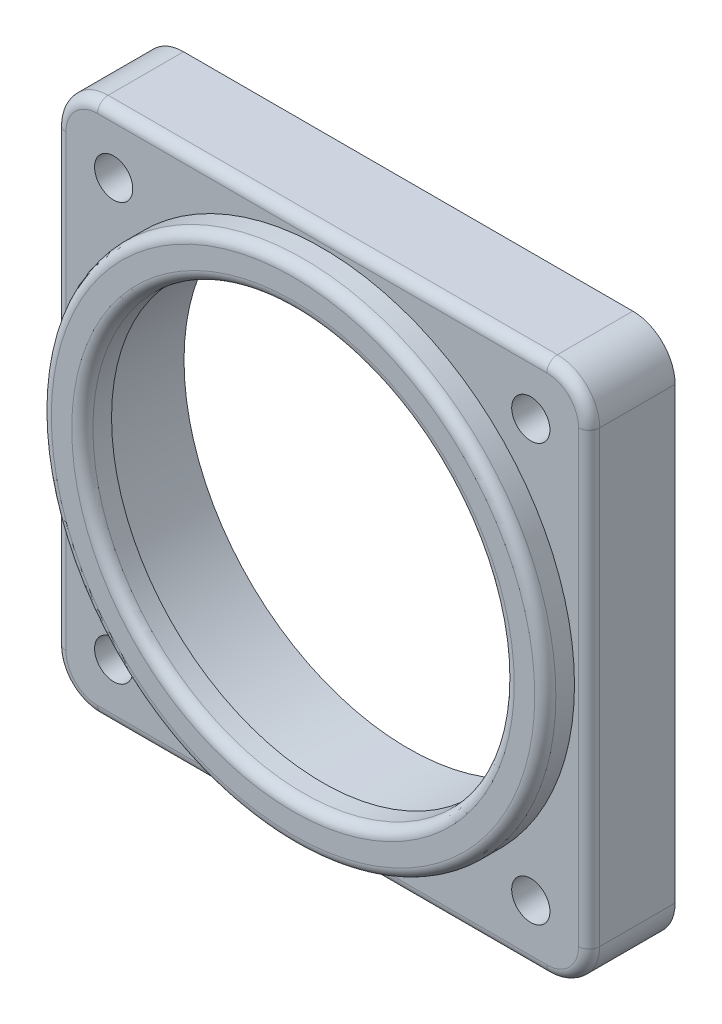
ISO-10303-21;
HEADER;
FILE_DESCRIPTION(('STEP AP214'),'2;1');
FILE_NAME('part.step','',(''),(''),'','','');
FILE_SCHEMA(('AUTOMOTIVE_DESIGN { 1 0 10303 214 1 1 1 1 }'));
ENDSEC;
DATA;
#1=APPLICATION_CONTEXT('core data for automotive mechanical design processes');
#2=APPLICATION_PROTOCOL_DEFINITION('international standard','automotive_design',2000,#1);
#3=PRODUCT_CONTEXT('',#1,'mechanical');
#4=PRODUCT('Part','Part','',(#3));
#5=PRODUCT_RELATED_PRODUCT_CATEGORY('part','',(#4));
#6=PRODUCT_DEFINITION_FORMATION('','',#4);
#7=PRODUCT_DEFINITION_CONTEXT('part definition',#1,'design');
#8=PRODUCT_DEFINITION('design','',#6,#7);
#9=PRODUCT_DEFINITION_SHAPE('','',#8);
#10=(LENGTH_UNIT() NAMED_UNIT(*) SI_UNIT(.MILLI.,.METRE.));
#11=(NAMED_UNIT(*) PLANE_ANGLE_UNIT() SI_UNIT($,.RADIAN.));
#12=(NAMED_UNIT(*) SI_UNIT($,.STERADIAN.) SOLID_ANGLE_UNIT());
#13=UNCERTAINTY_MEASURE_WITH_UNIT(LENGTH_MEASURE(1.E-05),#10,'distance_accuracy_value','');
#14=(GEOMETRIC_REPRESENTATION_CONTEXT(3) GLOBAL_UNCERTAINTY_ASSIGNED_CONTEXT((#13)) GLOBAL_UNIT_ASSIGNED_CONTEXT((#10,
#11,#12)) REPRESENTATION_CONTEXT('',''));
#15=CARTESIAN_POINT('',(0.,0.,0.));
#16=DIRECTION('',(0.,0.,1.));
#17=DIRECTION('',(1.,0.,0.));
#18=AXIS2_PLACEMENT_3D('',#15,#16,#17);
#19=CARTESIAN_POINT('',(0.,0.,81.3779438461318));
#20=DIRECTION('',(0.,0.,-1.));
#21=DIRECTION('',(-1.,0.,0.));
#22=AXIS2_PLACEMENT_3D('',#19,#20,#21);
#23=CYLINDRICAL_SURFACE('',#22,25.3365);
#24=CARTESIAN_POINT('',(0.,0.,9.71549999999999));
#25=DIRECTION('',(0.,0.,1.));
#26=DIRECTION('',(1.,0.,0.));
#27=AXIS2_PLACEMENT_3D('',#24,#25,#26);
#28=CIRCLE('',#27,25.3365);
#29=CARTESIAN_POINT('',(25.3365,0.,9.71549999999999));
#30=VERTEX_POINT('',#29);
#31=EDGE_CURVE('E222',#30,#30,#28,.F.);
#32=ORIENTED_EDGE('',*,*,#31,.F.);
#33=EDGE_LOOP('',(#32));
#34=FACE_BOUND('',#33,.T.);
#35=CARTESIAN_POINT('',(0.,0.,0.));
#36=DIRECTION('',(0.,0.,-1.));
#37=DIRECTION('',(-1.,0.,0.));
#38=AXIS2_PLACEMENT_3D('',#35,#36,#37);
#39=CIRCLE('',#38,25.3365);
#40=CARTESIAN_POINT('',(-25.3365,0.,0.));
#41=VERTEX_POINT('',#40);
#42=EDGE_CURVE('E60',#41,#41,#39,.F.);
#43=ORIENTED_EDGE('',*,*,#42,.F.);
#44=EDGE_LOOP('',(#43));
#45=FACE_BOUND('',#44,.T.);
#46=ADVANCED_FACE('F56',(#34,#45),#23,.F.);
#47=CARTESIAN_POINT('',(0.,-30.1625000000023,9.71549999999999));
#48=DIRECTION('',(0.,-1.,0.));
#49=DIRECTION('',(0.,0.,-1.));
#50=AXIS2_PLACEMENT_3D('',#47,#48,#49);
#51=PLANE('',#50);
#52=DIRECTION('',(0.,0.,-1.));
#53=VECTOR('',#52,1.);
#54=CARTESIAN_POINT('',(25.3873000000011,-30.1625,9.71549999999999));
#55=LINE('',#54,#53);
#56=CARTESIAN_POINT('',(25.3873000000011,-30.1625,8.52169999999999));
#57=VERTEX_POINT('',#56);
#58=CARTESIAN_POINT('',(25.3873000000011,-30.1625,0.));
#59=VERTEX_POINT('',#58);
#60=EDGE_CURVE('E148',#57,#59,#55,.T.);
#61=ORIENTED_EDGE('',*,*,#60,.F.);
#62=DIRECTION('',(-1.,0.,0.));
#63=VECTOR('',#62,1.);
#64=CARTESIAN_POINT('',(0.,-30.1625000000023,8.52169999999999));
#65=LINE('',#64,#63);
#66=CARTESIAN_POINT('',(-25.3873000000011,-30.1625,8.52169999999999));
#67=VERTEX_POINT('',#66);
#68=EDGE_CURVE('E245',#57,#67,#65,.T.);
#69=ORIENTED_EDGE('',*,*,#68,.T.);
#70=DIRECTION('',(0.,0.,-1.));
#71=VECTOR('',#70,1.);
#72=CARTESIAN_POINT('',(-25.3873000000011,-30.1625,9.71549999999999));
#73=LINE('',#72,#71);
#74=CARTESIAN_POINT('',(-25.3873000000011,-30.1625,0.));
#75=VERTEX_POINT('',#74);
#76=EDGE_CURVE('E165',#67,#75,#73,.T.);
#77=ORIENTED_EDGE('',*,*,#76,.T.);
#78=DIRECTION('',(-1.,0.,0.));
#79=VECTOR('',#78,1.);
#80=CARTESIAN_POINT('',(0.,-30.1625000000023,0.));
#81=LINE('',#80,#79);
#82=EDGE_CURVE('E162',#59,#75,#81,.T.);
#83=ORIENTED_EDGE('',*,*,#82,.F.);
#84=EDGE_LOOP('',(#61,#69,#77,#83));
#85=FACE_BOUND('',#84,.T.);
#86=ADVANCED_FACE('F163',(#85),#51,.T.);
#87=CARTESIAN_POINT('',(25.3873000000011,-25.3873,9.71549999999999));
#88=DIRECTION('',(0.,0.,-1.));
#89=DIRECTION('',(-1.,0.,0.));
#90=AXIS2_PLACEMENT_3D('',#87,#88,#89);
#91=CYLINDRICAL_SURFACE('',#90,4.7752);
#92=DIRECTION('',(0.,0.,-1.));
#93=VECTOR('',#92,1.);
#94=CARTESIAN_POINT('',(30.1625000000011,-25.3873,9.71549999999999));
#95=LINE('',#94,#93);
#96=CARTESIAN_POINT('',(30.1625000000011,-25.3873,8.52169999999999));
#97=VERTEX_POINT('',#96);
#98=CARTESIAN_POINT('',(30.1625000000011,-25.3873,0.));
#99=VERTEX_POINT('',#98);
#100=EDGE_CURVE('E159',#97,#99,#95,.T.);
#101=ORIENTED_EDGE('',*,*,#100,.F.);
#102=CARTESIAN_POINT('',(25.3873000000011,-25.3873,8.52169999999999));
#103=DIRECTION('',(0.,0.,1.));
#104=DIRECTION('',(1.,0.,0.));
#105=AXIS2_PLACEMENT_3D('',#102,#103,#104);
#106=CIRCLE('',#105,4.7752);
#107=EDGE_CURVE('E155',#97,#57,#106,.F.);
#108=ORIENTED_EDGE('',*,*,#107,.T.);
#109=ORIENTED_EDGE('',*,*,#60,.T.);
#110=CARTESIAN_POINT('',(25.3873000000011,-25.3873,0.));
#111=DIRECTION('',(0.,0.,1.));
#112=DIRECTION('',(1.,0.,0.));
#113=AXIS2_PLACEMENT_3D('',#110,#111,#112);
#114=CIRCLE('',#113,4.7752);
#115=EDGE_CURVE('E153',#99,#59,#114,.F.);
#116=ORIENTED_EDGE('',*,*,#115,.F.);
#117=EDGE_LOOP('',(#101,#108,#109,#116));
#118=FACE_BOUND('',#117,.T.);
#119=ADVANCED_FACE('F151',(#118),#91,.T.);
#120=CARTESIAN_POINT('',(30.1625000000011,0.,9.71549999999999));
#121=DIRECTION('',(-1.,0.,0.));
#122=DIRECTION('',(0.,0.,1.));
#123=AXIS2_PLACEMENT_3D('',#120,#121,#122);
#124=PLANE('',#123);
#125=DIRECTION('',(0.,0.,-1.));
#126=VECTOR('',#125,1.);
#127=CARTESIAN_POINT('',(30.1625000000011,25.3873,9.71549999999999));
#128=LINE('',#127,#126);
#129=CARTESIAN_POINT('',(30.1625000000011,25.3873,8.52169999999999));
#130=VERTEX_POINT('',#129);
#131=CARTESIAN_POINT('',(30.1625000000011,25.3873,0.));
#132=VERTEX_POINT('',#131);
#133=EDGE_CURVE('E217',#130,#132,#128,.T.);
#134=ORIENTED_EDGE('',*,*,#133,.F.);
#135=DIRECTION('',(0.,1.,0.));
#136=VECTOR('',#135,1.);
#137=CARTESIAN_POINT('',(30.1625000000011,-25.3873,8.52169999999999));
#138=LINE('',#137,#136);
#139=EDGE_CURVE('E242',#130,#97,#138,.F.);
#140=ORIENTED_EDGE('',*,*,#139,.T.);
#141=ORIENTED_EDGE('',*,*,#100,.T.);
#142=DIRECTION('',(0.,1.,0.));
#143=VECTOR('',#142,1.);
#144=CARTESIAN_POINT('',(30.1625000000011,0.,0.));
#145=LINE('',#144,#143);
#146=EDGE_CURVE('E176',#99,#132,#145,.T.);
#147=ORIENTED_EDGE('',*,*,#146,.T.);
#148=EDGE_LOOP('',(#134,#140,#141,#147));
#149=FACE_BOUND('',#148,.T.);
#150=ADVANCED_FACE('F389',(#149),#124,.F.);
#151=CARTESIAN_POINT('',(25.3873000000011,25.3873,9.71549999999999));
#152=DIRECTION('',(0.,0.,-1.));
#153=DIRECTION('',(-1.,0.,0.));
#154=AXIS2_PLACEMENT_3D('',#151,#152,#153);
#155=CYLINDRICAL_SURFACE('',#154,4.7752);
#156=DIRECTION('',(0.,0.,-1.));
#157=VECTOR('',#156,1.);
#158=CARTESIAN_POINT('',(25.3873000000011,30.1625,9.71549999999999));
#159=LINE('',#158,#157);
#160=CARTESIAN_POINT('',(25.3873000000011,30.1625,8.52169999999999));
#161=VERTEX_POINT('',#160);
#162=CARTESIAN_POINT('',(25.3873000000011,30.1625,0.));
#163=VERTEX_POINT('',#162);
#164=EDGE_CURVE('E215',#161,#163,#159,.T.);
#165=ORIENTED_EDGE('',*,*,#164,.F.);
#166=CARTESIAN_POINT('',(25.3873000000011,25.3873,8.52169999999999));
#167=DIRECTION('',(0.,0.,1.));
#168=DIRECTION('',(1.,0.,0.));
#169=AXIS2_PLACEMENT_3D('',#166,#167,#168);
#170=CIRCLE('',#169,4.7752);
#171=EDGE_CURVE('E158',#161,#130,#170,.F.);
#172=ORIENTED_EDGE('',*,*,#171,.T.);
#173=ORIENTED_EDGE('',*,*,#133,.T.);
#174=CARTESIAN_POINT('',(25.3873000000011,25.3873,0.));
#175=DIRECTION('',(0.,0.,1.));
#176=DIRECTION('',(1.,0.,0.));
#177=AXIS2_PLACEMENT_3D('',#174,#175,#176);
#178=CIRCLE('',#177,4.7752);
#179=EDGE_CURVE('E178',#163,#132,#178,.F.);
#180=ORIENTED_EDGE('',*,*,#179,.F.);
#181=EDGE_LOOP('',(#165,#172,#173,#180));
#182=FACE_BOUND('',#181,.T.);
#183=ADVANCED_FACE('F392',(#182),#155,.T.);
#184=CARTESIAN_POINT('',(0.,30.1625,9.71549999999999));
#185=DIRECTION('',(0.,-1.,0.));
#186=DIRECTION('',(1.,0.,0.));
#187=AXIS2_PLACEMENT_3D('',#184,#185,#186);
#188=PLANE('',#187);
#189=DIRECTION('',(0.,0.,-1.));
#190=VECTOR('',#189,1.);
#191=CARTESIAN_POINT('',(-25.3873000000011,30.1625,9.71549999999999));
#192=LINE('',#191,#190);
#193=CARTESIAN_POINT('',(-25.3873000000011,30.1625,8.52169999999999));
#194=VERTEX_POINT('',#193);
#195=CARTESIAN_POINT('',(-25.3873000000011,30.1625,0.));
#196=VERTEX_POINT('',#195);
#197=EDGE_CURVE('E213',#194,#196,#192,.T.);
#198=ORIENTED_EDGE('',*,*,#197,.F.);
#199=DIRECTION('',(-1.,0.,0.));
#200=VECTOR('',#199,1.);
#201=CARTESIAN_POINT('',(25.3873000000011,30.1625,8.52169999999999));
#202=LINE('',#201,#200);
#203=EDGE_CURVE('E65',#194,#161,#202,.F.);
#204=ORIENTED_EDGE('',*,*,#203,.T.);
#205=ORIENTED_EDGE('',*,*,#164,.T.);
#206=DIRECTION('',(-1.,0.,0.));
#207=VECTOR('',#206,1.);
#208=CARTESIAN_POINT('',(0.,30.1625,0.));
#209=LINE('',#208,#207);
#210=EDGE_CURVE('E183',#163,#196,#209,.T.);
#211=ORIENTED_EDGE('',*,*,#210,.T.);
#212=EDGE_LOOP('',(#198,#204,#205,#211));
#213=FACE_BOUND('',#212,.T.);
#214=ADVANCED_FACE('F396',(#213),#188,.F.);
#215=CARTESIAN_POINT('',(-25.3873000000011,25.3873,9.71549999999999));
#216=DIRECTION('',(0.,0.,-1.));
#217=DIRECTION('',(-1.,0.,0.));
#218=AXIS2_PLACEMENT_3D('',#215,#216,#217);
#219=CYLINDRICAL_SURFACE('',#218,4.7752);
#220=DIRECTION('',(0.,0.,-1.));
#221=VECTOR('',#220,1.);
#222=CARTESIAN_POINT('',(-30.1625000000011,25.3873,9.71549999999999));
#223=LINE('',#222,#221);
#224=CARTESIAN_POINT('',(-30.1625000000011,25.3873,8.52169999999999));
#225=VERTEX_POINT('',#224);
#226=CARTESIAN_POINT('',(-30.1625000000011,25.3873,0.));
#227=VERTEX_POINT('',#226);
#228=EDGE_CURVE('E211',#225,#227,#223,.T.);
#229=ORIENTED_EDGE('',*,*,#228,.F.);
#230=CARTESIAN_POINT('',(-25.3873000000011,25.3873,8.52169999999999));
#231=DIRECTION('',(0.,0.,1.));
#232=DIRECTION('',(1.,0.,0.));
#233=AXIS2_PLACEMENT_3D('',#230,#231,#232);
#234=CIRCLE('',#233,4.7752);
#235=EDGE_CURVE('E73',#225,#194,#234,.F.);
#236=ORIENTED_EDGE('',*,*,#235,.T.);
#237=ORIENTED_EDGE('',*,*,#197,.T.);
#238=CARTESIAN_POINT('',(-25.3873000000011,25.3873,0.));
#239=DIRECTION('',(0.,0.,1.));
#240=DIRECTION('',(1.,0.,0.));
#241=AXIS2_PLACEMENT_3D('',#238,#239,#240);
#242=CIRCLE('',#241,4.7752);
#243=EDGE_CURVE('E186',#196,#227,#242,.T.);
#244=ORIENTED_EDGE('',*,*,#243,.T.);
#245=EDGE_LOOP('',(#229,#236,#237,#244));
#246=FACE_BOUND('',#245,.T.);
#247=ADVANCED_FACE('F400',(#246),#219,.T.);
#248=CARTESIAN_POINT('',(-30.1625000000011,0.,9.71549999999999));
#249=DIRECTION('',(-1.,0.,0.));
#250=DIRECTION('',(0.,0.,1.));
#251=AXIS2_PLACEMENT_3D('',#248,#249,#250);
#252=PLANE('',#251);
#253=DIRECTION('',(0.,0.,-1.));
#254=VECTOR('',#253,1.);
#255=CARTESIAN_POINT('',(-30.1625000000011,-25.3873,9.71549999999999));
#256=LINE('',#255,#254);
#257=CARTESIAN_POINT('',(-30.1625000000011,-25.3873,8.52169999999999));
#258=VERTEX_POINT('',#257);
#259=CARTESIAN_POINT('',(-30.1625000000011,-25.3873,0.));
#260=VERTEX_POINT('',#259);
#261=EDGE_CURVE('E208',#258,#260,#256,.T.);
#262=ORIENTED_EDGE('',*,*,#261,.F.);
#263=DIRECTION('',(0.,1.,0.));
#264=VECTOR('',#263,1.);
#265=CARTESIAN_POINT('',(-30.1625000000011,0.,8.52169999999999));
#266=LINE('',#265,#264);
#267=EDGE_CURVE('E81',#258,#225,#266,.T.);
#268=ORIENTED_EDGE('',*,*,#267,.T.);
#269=ORIENTED_EDGE('',*,*,#228,.T.);
#270=DIRECTION('',(0.,1.,0.));
#271=VECTOR('',#270,1.);
#272=CARTESIAN_POINT('',(-30.1625000000011,0.,0.));
#273=LINE('',#272,#271);
#274=EDGE_CURVE('E189',#260,#227,#273,.T.);
#275=ORIENTED_EDGE('',*,*,#274,.F.);
#276=EDGE_LOOP('',(#262,#268,#269,#275));
#277=FACE_BOUND('',#276,.T.);
#278=ADVANCED_FACE('F404',(#277),#252,.T.);
#279=CARTESIAN_POINT('',(-23.5731723178075,23.5731723178056,9.71549999999999));
#280=DIRECTION('',(0.,0.,-1.));
#281=DIRECTION('',(-1.,0.,0.));
#282=AXIS2_PLACEMENT_3D('',#279,#280,#281);
#283=CYLINDRICAL_SURFACE('',#282,2.15900000000118);
#284=CARTESIAN_POINT('',(-23.5731723178075,23.5731723178056,9.71549999999999));
#285=DIRECTION('',(0.,0.,1.));
#286=DIRECTION('',(1.,0.,0.));
#287=AXIS2_PLACEMENT_3D('',#284,#285,#286);
#288=CIRCLE('',#287,2.15900000000118);
#289=CARTESIAN_POINT('',(-21.4141723178063,23.5731723178056,9.71549999999999));
#290=VERTEX_POINT('',#289);
#291=EDGE_CURVE('E297',#290,#290,#288,.T.);
#292=ORIENTED_EDGE('',*,*,#291,.T.);
#293=EDGE_LOOP('',(#292));
#294=FACE_BOUND('',#293,.T.);
#295=CARTESIAN_POINT('',(-23.5731723178075,23.5731723178056,0.));
#296=DIRECTION('',(0.,0.,1.));
#297=DIRECTION('',(1.,0.,0.));
#298=AXIS2_PLACEMENT_3D('',#295,#296,#297);
#299=CIRCLE('',#298,2.15900000000118);
#300=CARTESIAN_POINT('',(-21.4141723178063,23.5731723178056,0.));
#301=VERTEX_POINT('',#300);
#302=EDGE_CURVE('E203',#301,#301,#299,.T.);
#303=ORIENTED_EDGE('',*,*,#302,.F.);
#304=EDGE_LOOP('',(#303));
#305=FACE_BOUND('',#304,.T.);
#306=ADVANCED_FACE('F406',(#294,#305),#283,.F.);
#307=CARTESIAN_POINT('',(23.573172317807,23.573172317806,9.71549999999999));
#308=DIRECTION('',(0.,0.,-1.));
#309=DIRECTION('',(-1.,0.,0.));
#310=AXIS2_PLACEMENT_3D('',#307,#308,#309);
#311=CYLINDRICAL_SURFACE('',#310,2.15899999999951);
#312=CARTESIAN_POINT('',(23.573172317807,23.573172317806,9.71549999999999));
#313=DIRECTION('',(0.,0.,1.));
#314=DIRECTION('',(1.,0.,0.));
#315=AXIS2_PLACEMENT_3D('',#312,#313,#314);
#316=CIRCLE('',#315,2.15899999999951);
#317=CARTESIAN_POINT('',(25.7321723178065,23.573172317806,9.71549999999999));
#318=VERTEX_POINT('',#317);
#319=EDGE_CURVE('E294',#318,#318,#316,.T.);
#320=ORIENTED_EDGE('',*,*,#319,.T.);
#321=EDGE_LOOP('',(#320));
#322=FACE_BOUND('',#321,.T.);
#323=CARTESIAN_POINT('',(23.573172317807,23.573172317806,0.));
#324=DIRECTION('',(0.,0.,1.));
#325=DIRECTION('',(1.,0.,0.));
#326=AXIS2_PLACEMENT_3D('',#323,#324,#325);
#327=CIRCLE('',#326,2.15899999999951);
#328=CARTESIAN_POINT('',(25.7321723178065,23.573172317806,0.));
#329=VERTEX_POINT('',#328);
#330=EDGE_CURVE('E200',#329,#329,#327,.T.);
#331=ORIENTED_EDGE('',*,*,#330,.F.);
#332=EDGE_LOOP('',(#331));
#333=FACE_BOUND('',#332,.T.);
#334=ADVANCED_FACE('F414',(#322,#333),#311,.F.);
#335=CARTESIAN_POINT('',(23.5731723178046,-23.5731723178084,9.71549999999999));
#336=DIRECTION('',(0.,0.,-1.));
#337=DIRECTION('',(-1.,0.,0.));
#338=AXIS2_PLACEMENT_3D('',#335,#336,#337);
#339=CYLINDRICAL_SURFACE('',#338,2.15899999999784);
#340=CARTESIAN_POINT('',(23.5731723178046,-23.5731723178084,9.71549999999999));
#341=DIRECTION('',(0.,0.,1.));
#342=DIRECTION('',(1.,0.,0.));
#343=AXIS2_PLACEMENT_3D('',#340,#341,#342);
#344=CIRCLE('',#343,2.15899999999784);
#345=CARTESIAN_POINT('',(25.7321723178025,-23.5731723178084,9.71549999999999));
#346=VERTEX_POINT('',#345);
#347=EDGE_CURVE('E291',#346,#346,#344,.T.);
#348=ORIENTED_EDGE('',*,*,#347,.T.);
#349=EDGE_LOOP('',(#348));
#350=FACE_BOUND('',#349,.T.);
#351=CARTESIAN_POINT('',(23.5731723178046,-23.5731723178084,0.));
#352=DIRECTION('',(0.,0.,1.));
#353=DIRECTION('',(1.,0.,0.));
#354=AXIS2_PLACEMENT_3D('',#351,#352,#353);
#355=CIRCLE('',#354,2.15899999999784);
#356=CARTESIAN_POINT('',(25.7321723178025,-23.5731723178084,0.));
#357=VERTEX_POINT('',#356);
#358=EDGE_CURVE('E197',#357,#357,#355,.T.);
#359=ORIENTED_EDGE('',*,*,#358,.F.);
#360=EDGE_LOOP('',(#359));
#361=FACE_BOUND('',#360,.T.);
#362=ADVANCED_FACE('F410',(#350,#361),#339,.F.);
#363=CARTESIAN_POINT('',(-23.5731723178098,-23.5731723178032,9.71549999999999));
#364=DIRECTION('',(0.,0.,-1.));
#365=DIRECTION('',(-1.,0.,0.));
#366=AXIS2_PLACEMENT_3D('',#363,#364,#365);
#367=CYLINDRICAL_SURFACE('',#366,2.15899999999618);
#368=CARTESIAN_POINT('',(-23.5731723178098,-23.5731723178032,9.71549999999999));
#369=DIRECTION('',(0.,0.,1.));
#370=DIRECTION('',(1.,0.,0.));
#371=AXIS2_PLACEMENT_3D('',#368,#369,#370);
#372=CIRCLE('',#371,2.15899999999618);
#373=CARTESIAN_POINT('',(-21.4141723178137,-23.5731723178032,9.71549999999999));
#374=VERTEX_POINT('',#373);
#375=EDGE_CURVE('E206',#374,#374,#372,.T.);
#376=ORIENTED_EDGE('',*,*,#375,.T.);
#377=EDGE_LOOP('',(#376));
#378=FACE_BOUND('',#377,.T.);
#379=CARTESIAN_POINT('',(-23.5731723178098,-23.5731723178032,0.));
#380=DIRECTION('',(0.,0.,1.));
#381=DIRECTION('',(1.,0.,0.));
#382=AXIS2_PLACEMENT_3D('',#379,#380,#381);
#383=CIRCLE('',#382,2.15899999999618);
#384=CARTESIAN_POINT('',(-21.4141723178137,-23.5731723178032,0.));
#385=VERTEX_POINT('',#384);
#386=EDGE_CURVE('E194',#385,#385,#383,.T.);
#387=ORIENTED_EDGE('',*,*,#386,.F.);
#388=EDGE_LOOP('',(#387));
#389=FACE_BOUND('',#388,.T.);
#390=ADVANCED_FACE('F315',(#378,#389),#367,.F.);
#391=CARTESIAN_POINT('',(-25.3873000000011,-25.3873,9.71549999999999));
#392=DIRECTION('',(0.,0.,-1.));
#393=DIRECTION('',(-1.,0.,0.));
#394=AXIS2_PLACEMENT_3D('',#391,#392,#393);
#395=CYLINDRICAL_SURFACE('',#394,4.7752);
#396=ORIENTED_EDGE('',*,*,#76,.F.);
#397=CARTESIAN_POINT('',(-25.3873000000011,-25.3873,8.52169999999999));
#398=DIRECTION('',(0.,0.,1.));
#399=DIRECTION('',(1.,0.,0.));
#400=AXIS2_PLACEMENT_3D('',#397,#398,#399);
#401=CIRCLE('',#400,4.7752);
#402=EDGE_CURVE('E247',#67,#258,#401,.F.);
#403=ORIENTED_EDGE('',*,*,#402,.T.);
#404=ORIENTED_EDGE('',*,*,#261,.T.);
#405=CARTESIAN_POINT('',(-25.3873000000011,-25.3873,0.));
#406=DIRECTION('',(0.,0.,1.));
#407=DIRECTION('',(1.,0.,0.));
#408=AXIS2_PLACEMENT_3D('',#405,#406,#407);
#409=CIRCLE('',#408,4.7752);
#410=EDGE_CURVE('E192',#75,#260,#409,.F.);
#411=ORIENTED_EDGE('',*,*,#410,.F.);
#412=EDGE_LOOP('',(#396,#403,#404,#411));
#413=FACE_BOUND('',#412,.T.);
#414=ADVANCED_FACE('F306',(#413),#395,.T.);
#415=CARTESIAN_POINT('',(0.,0.,9.71549999999999));
#416=DIRECTION('',(0.,0.,1.));
#417=DIRECTION('',(1.,0.,0.));
#418=AXIS2_PLACEMENT_3D('',#415,#416,#417);
#419=PLANE('',#418);
#420=DIRECTION('',(0.,1.,0.));
#421=VECTOR('',#420,1.);
#422=CARTESIAN_POINT('',(28.9687000000011,25.3873,9.71549999999999));
#423=LINE('',#422,#421);
#424=CARTESIAN_POINT('',(28.9687000000011,-25.3873,9.71549999999999));
#425=VERTEX_POINT('',#424);
#426=CARTESIAN_POINT('',(28.9687000000011,25.3873,9.71549999999999));
#427=VERTEX_POINT('',#426);
#428=EDGE_CURVE('E237',#425,#427,#423,.T.);
#429=ORIENTED_EDGE('',*,*,#428,.T.);
#430=CARTESIAN_POINT('',(25.3873000000011,25.3873,9.71549999999999));
#431=DIRECTION('',(0.,0.,1.));
#432=DIRECTION('',(1.,0.,0.));
#433=AXIS2_PLACEMENT_3D('',#430,#431,#432);
#434=CIRCLE('',#433,3.5814);
#435=CARTESIAN_POINT('',(25.3873000000011,28.9687,9.71549999999999));
#436=VERTEX_POINT('',#435);
#437=EDGE_CURVE('E239',#427,#436,#434,.T.);
#438=ORIENTED_EDGE('',*,*,#437,.T.);
#439=DIRECTION('',(-1.,0.,0.));
#440=VECTOR('',#439,1.);
#441=CARTESIAN_POINT('',(-25.3873000000011,28.9687,9.71549999999999));
#442=LINE('',#441,#440);
#443=CARTESIAN_POINT('',(-25.3873000000011,28.9687,9.71549999999999));
#444=VERTEX_POINT('',#443);
#445=EDGE_CURVE('E225',#436,#444,#442,.T.);
#446=ORIENTED_EDGE('',*,*,#445,.T.);
#447=CARTESIAN_POINT('',(-25.3873000000011,25.3873,9.71549999999999));
#448=DIRECTION('',(0.,0.,1.));
#449=DIRECTION('',(1.,0.,0.));
#450=AXIS2_PLACEMENT_3D('',#447,#448,#449);
#451=CIRCLE('',#450,3.5814);
#452=CARTESIAN_POINT('',(-28.9687000000011,25.3873,9.71549999999999));
#453=VERTEX_POINT('',#452);
#454=EDGE_CURVE('E227',#444,#453,#451,.T.);
#455=ORIENTED_EDGE('',*,*,#454,.T.);
#456=DIRECTION('',(0.,1.,0.));
#457=VECTOR('',#456,1.);
#458=CARTESIAN_POINT('',(-28.9687000000011,0.,9.71549999999999));
#459=LINE('',#458,#457);
#460=CARTESIAN_POINT('',(-28.9687000000011,-25.3873,9.71549999999999));
#461=VERTEX_POINT('',#460);
#462=EDGE_CURVE('E229',#453,#461,#459,.F.);
#463=ORIENTED_EDGE('',*,*,#462,.T.);
#464=CARTESIAN_POINT('',(-25.3873000000011,-25.3873,9.71549999999999));
#465=DIRECTION('',(0.,0.,1.));
#466=DIRECTION('',(1.,0.,0.));
#467=AXIS2_PLACEMENT_3D('',#464,#465,#466);
#468=CIRCLE('',#467,3.5814);
#469=CARTESIAN_POINT('',(-25.3873000000011,-28.9687,9.71549999999999));
#470=VERTEX_POINT('',#469);
#471=EDGE_CURVE('E231',#461,#470,#468,.T.);
#472=ORIENTED_EDGE('',*,*,#471,.T.);
#473=DIRECTION('',(-1.,0.,0.));
#474=VECTOR('',#473,1.);
#475=CARTESIAN_POINT('',(0.,-28.9687000000023,9.71549999999999));
#476=LINE('',#475,#474);
#477=CARTESIAN_POINT('',(25.3873000000011,-28.9687000000023,9.71549999999999));
#478=VERTEX_POINT('',#477);
#479=EDGE_CURVE('E233',#470,#478,#476,.F.);
#480=ORIENTED_EDGE('',*,*,#479,.T.);
#481=CARTESIAN_POINT('',(25.3873000000011,-25.3873,9.71549999999999));
#482=DIRECTION('',(0.,0.,1.));
#483=DIRECTION('',(1.,0.,0.));
#484=AXIS2_PLACEMENT_3D('',#481,#482,#483);
#485=CIRCLE('',#484,3.5814);
#486=EDGE_CURVE('E235',#478,#425,#485,.T.);
#487=ORIENTED_EDGE('',*,*,#486,.T.);
#488=EDGE_LOOP('',(#429,#438,#446,#455,#463,#472,#480,#487));
#489=FACE_BOUND('',#488,.T.);
#490=ORIENTED_EDGE('',*,*,#375,.F.);
#491=EDGE_LOOP('',(#490));
#492=FACE_BOUND('',#491,.T.);
#493=ORIENTED_EDGE('',*,*,#347,.F.);
#494=EDGE_LOOP('',(#493));
#495=FACE_BOUND('',#494,.T.);
#496=ORIENTED_EDGE('',*,*,#319,.F.);
#497=EDGE_LOOP('',(#496));
#498=FACE_BOUND('',#497,.T.);
#499=ORIENTED_EDGE('',*,*,#291,.F.);
#500=EDGE_LOOP('',(#499));
#501=FACE_BOUND('',#500,.T.);
#502=CARTESIAN_POINT('',(0.,0.,9.71549999999999));
#503=DIRECTION('',(0.,0.,1.));
#504=DIRECTION('',(1.,0.,0.));
#505=AXIS2_PLACEMENT_3D('',#502,#503,#504);
#506=CIRCLE('',#505,28.5115);
#507=CARTESIAN_POINT('',(28.5115,0.,9.71549999999999));
#508=VERTEX_POINT('',#507);
#509=EDGE_CURVE('E209',#508,#508,#506,.T.);
#510=ORIENTED_EDGE('',*,*,#509,.F.);
#511=EDGE_LOOP('',(#510));
#512=FACE_BOUND('',#511,.T.);
#513=ADVANCED_FACE('F304',(#489,#492,#495,#498,#501,#512),#419,.T.);
#514=CARTESIAN_POINT('',(0.,0.,0.));
#515=DIRECTION('',(0.,0.,1.));
#516=DIRECTION('',(1.,0.,0.));
#517=AXIS2_PLACEMENT_3D('',#514,#515,#516);
#518=PLANE('',#517);
#519=ORIENTED_EDGE('',*,*,#82,.T.);
#520=ORIENTED_EDGE('',*,*,#410,.T.);
#521=ORIENTED_EDGE('',*,*,#274,.T.);
#522=ORIENTED_EDGE('',*,*,#243,.F.);
#523=ORIENTED_EDGE('',*,*,#210,.F.);
#524=ORIENTED_EDGE('',*,*,#179,.T.);
#525=ORIENTED_EDGE('',*,*,#146,.F.);
#526=ORIENTED_EDGE('',*,*,#115,.T.);
#527=EDGE_LOOP('',(#519,#520,#521,#522,#523,#524,#525,#526));
#528=FACE_BOUND('',#527,.T.);
#529=ORIENTED_EDGE('',*,*,#386,.T.);
#530=EDGE_LOOP('',(#529));
#531=FACE_BOUND('',#530,.T.);
#532=ORIENTED_EDGE('',*,*,#358,.T.);
#533=EDGE_LOOP('',(#532));
#534=FACE_BOUND('',#533,.T.);
#535=ORIENTED_EDGE('',*,*,#330,.T.);
#536=EDGE_LOOP('',(#535));
#537=FACE_BOUND('',#536,.T.);
#538=ORIENTED_EDGE('',*,*,#302,.T.);
#539=EDGE_LOOP('',(#538));
#540=FACE_BOUND('',#539,.T.);
#541=ORIENTED_EDGE('',*,*,#42,.T.);
#542=EDGE_LOOP('',(#541));
#543=FACE_BOUND('',#542,.T.);
#544=ADVANCED_FACE('F172',(#528,#531,#534,#537,#540,#543),#518,.F.);
#545=CARTESIAN_POINT('',(0.,0.,13.0175));
#546=DIRECTION('',(0.,0.,-1.));
#547=DIRECTION('',(-1.,0.,0.));
#548=AXIS2_PLACEMENT_3D('',#545,#546,#547);
#549=CYLINDRICAL_SURFACE('',#548,23.8125);
#550=CARTESIAN_POINT('',(0.,0.,11.8237));
#551=DIRECTION('',(0.,0.,1.));
#552=DIRECTION('',(1.,0.,0.));
#553=AXIS2_PLACEMENT_3D('',#550,#551,#552);
#554=CIRCLE('',#553,23.8125);
#555=CARTESIAN_POINT('',(23.8125,0.,11.8237));
#556=VERTEX_POINT('',#555);
#557=EDGE_CURVE('E251',#556,#556,#554,.T.);
#558=ORIENTED_EDGE('',*,*,#557,.T.);
#559=EDGE_LOOP('',(#558));
#560=FACE_BOUND('',#559,.T.);
#561=CARTESIAN_POINT('',(0.,0.,9.71549999999999));
#562=DIRECTION('',(0.,0.,1.));
#563=DIRECTION('',(1.,0.,0.));
#564=AXIS2_PLACEMENT_3D('',#561,#562,#563);
#565=CIRCLE('',#564,23.8125);
#566=CARTESIAN_POINT('',(23.8125,0.,9.71549999999999));
#567=VERTEX_POINT('',#566);
#568=EDGE_CURVE('E169',#567,#567,#565,.T.);
#569=ORIENTED_EDGE('',*,*,#568,.F.);
#570=EDGE_LOOP('',(#569));
#571=FACE_BOUND('',#570,.T.);
#572=ADVANCED_FACE('F313',(#560,#571),#549,.F.);
#573=CARTESIAN_POINT('',(0.,0.,13.0175));
#574=DIRECTION('',(0.,0.,-1.));
#575=DIRECTION('',(-1.,0.,0.));
#576=AXIS2_PLACEMENT_3D('',#573,#574,#575);
#577=CYLINDRICAL_SURFACE('',#576,28.5115);
#578=CARTESIAN_POINT('',(0.,0.,11.8237));
#579=DIRECTION('',(0.,0.,1.));
#580=DIRECTION('',(1.,0.,0.));
#581=AXIS2_PLACEMENT_3D('',#578,#579,#580);
#582=CIRCLE('',#581,28.5115);
#583=CARTESIAN_POINT('',(28.5115,0.,11.8237));
#584=VERTEX_POINT('',#583);
#585=EDGE_CURVE('E14',#584,#584,#582,.F.);
#586=ORIENTED_EDGE('',*,*,#585,.T.);
#587=EDGE_LOOP('',(#586));
#588=FACE_BOUND('',#587,.T.);
#589=ORIENTED_EDGE('',*,*,#509,.T.);
#590=EDGE_LOOP('',(#589));
#591=FACE_BOUND('',#590,.T.);
#592=ADVANCED_FACE('F302',(#588,#591),#577,.T.);
#593=CARTESIAN_POINT('',(0.,0.,13.0175));
#594=DIRECTION('',(0.,0.,1.));
#595=DIRECTION('',(1.,0.,0.));
#596=AXIS2_PLACEMENT_3D('',#593,#594,#595);
#597=PLANE('',#596);
#598=CARTESIAN_POINT('',(0.,0.,13.0175));
#599=DIRECTION('',(0.,0.,1.));
#600=DIRECTION('',(1.,0.,0.));
#601=AXIS2_PLACEMENT_3D('',#598,#599,#600);
#602=CIRCLE('',#601,25.0063);
#603=CARTESIAN_POINT('',(25.0063,0.,13.0175));
#604=VERTEX_POINT('',#603);
#605=EDGE_CURVE('E257',#604,#604,#602,.F.);
#606=ORIENTED_EDGE('',*,*,#605,.T.);
#607=EDGE_LOOP('',(#606));
#608=FACE_BOUND('',#607,.T.);
#609=CARTESIAN_POINT('',(0.,0.,13.0175));
#610=DIRECTION('',(0.,0.,1.));
#611=DIRECTION('',(1.,0.,0.));
#612=AXIS2_PLACEMENT_3D('',#609,#610,#611);
#613=CIRCLE('',#612,27.3177);
#614=CARTESIAN_POINT('',(27.3177,0.,13.0175));
#615=VERTEX_POINT('',#614);
#616=EDGE_CURVE('E254',#615,#615,#613,.T.);
#617=ORIENTED_EDGE('',*,*,#616,.T.);
#618=EDGE_LOOP('',(#617));
#619=FACE_BOUND('',#618,.T.);
#620=ADVANCED_FACE('F333',(#608,#619),#597,.T.);
#621=CARTESIAN_POINT('',(0.,0.,9.71549999999999));
#622=DIRECTION('',(0.,0.,1.));
#623=DIRECTION('',(1.,0.,0.));
#624=AXIS2_PLACEMENT_3D('',#621,#622,#623);
#625=PLANE('',#624);
#626=ORIENTED_EDGE('',*,*,#568,.T.);
#627=EDGE_LOOP('',(#626));
#628=FACE_BOUND('',#627,.T.);
#629=ORIENTED_EDGE('',*,*,#31,.T.);
#630=EDGE_LOOP('',(#629));
#631=FACE_BOUND('',#630,.T.);
#632=ADVANCED_FACE('F329',(#628,#631),#625,.F.);
#633=CARTESIAN_POINT('',(-25.3873000000011,-25.3873,8.52169999999999));
#634=DIRECTION('',(0.,0.,1.));
#635=DIRECTION('',(1.,0.,0.));
#636=AXIS2_PLACEMENT_3D('',#633,#634,#635);
#637=TOROIDAL_SURFACE('',#636,3.5814,1.1938);
#638=CARTESIAN_POINT('',(-25.3873000000011,-28.9687,8.52169999999999));
#639=DIRECTION('',(1.,0.,0.));
#640=DIRECTION('',(0.,0.,-1.));
#641=AXIS2_PLACEMENT_3D('',#638,#639,#640);
#642=CIRCLE('',#641,1.1938);
#643=EDGE_CURVE('E277',#470,#67,#642,.T.);
#644=ORIENTED_EDGE('',*,*,#643,.F.);
#645=ORIENTED_EDGE('',*,*,#471,.F.);
#646=CARTESIAN_POINT('',(-28.9687000000011,-25.3873,8.52169999999999));
#647=DIRECTION('',(0.,1.,0.));
#648=DIRECTION('',(-1.,0.,0.));
#649=AXIS2_PLACEMENT_3D('',#646,#647,#648);
#650=CIRCLE('',#649,1.1938);
#651=EDGE_CURVE('E279',#258,#461,#650,.T.);
#652=ORIENTED_EDGE('',*,*,#651,.F.);
#653=ORIENTED_EDGE('',*,*,#402,.F.);
#654=EDGE_LOOP('',(#644,#645,#652,#653));
#655=FACE_BOUND('',#654,.T.);
#656=ADVANCED_FACE('F332',(#655),#637,.T.);
#657=CARTESIAN_POINT('',(-28.9687000000011,0.,8.52169999999999));
#658=DIRECTION('',(0.,1.,0.));
#659=DIRECTION('',(0.,0.,1.));
#660=AXIS2_PLACEMENT_3D('',#657,#658,#659);
#661=CYLINDRICAL_SURFACE('',#660,1.1938);
#662=ORIENTED_EDGE('',*,*,#651,.T.);
#663=ORIENTED_EDGE('',*,*,#462,.F.);
#664=CARTESIAN_POINT('',(-28.9687000000011,25.3873,8.52169999999999));
#665=DIRECTION('',(0.,1.,0.));
#666=DIRECTION('',(0.,0.,1.));
#667=AXIS2_PLACEMENT_3D('',#664,#665,#666);
#668=CIRCLE('',#667,1.1938);
#669=EDGE_CURVE('E274',#225,#453,#668,.T.);
#670=ORIENTED_EDGE('',*,*,#669,.F.);
#671=ORIENTED_EDGE('',*,*,#267,.F.);
#672=EDGE_LOOP('',(#662,#663,#670,#671));
#673=FACE_BOUND('',#672,.T.);
#674=ADVANCED_FACE('F364',(#673),#661,.T.);
#675=CARTESIAN_POINT('',(0.,-28.9687000000023,8.52169999999999));
#676=DIRECTION('',(-1.,0.,0.));
#677=DIRECTION('',(0.,0.,1.));
#678=AXIS2_PLACEMENT_3D('',#675,#676,#677);
#679=CYLINDRICAL_SURFACE('',#678,1.1938);
#680=ORIENTED_EDGE('',*,*,#643,.T.);
#681=ORIENTED_EDGE('',*,*,#68,.F.);
#682=CARTESIAN_POINT('',(25.3873000000011,-28.9687000000023,8.52169999999999));
#683=DIRECTION('',(1.,0.,0.));
#684=DIRECTION('',(0.,1.,0.));
#685=AXIS2_PLACEMENT_3D('',#682,#683,#684);
#686=CIRCLE('',#685,1.1938);
#687=EDGE_CURVE('E271',#478,#57,#686,.T.);
#688=ORIENTED_EDGE('',*,*,#687,.F.);
#689=ORIENTED_EDGE('',*,*,#479,.F.);
#690=EDGE_LOOP('',(#680,#681,#688,#689));
#691=FACE_BOUND('',#690,.T.);
#692=ADVANCED_FACE('F368',(#691),#679,.T.);
#693=CARTESIAN_POINT('',(-25.3873000000011,25.3873,8.52169999999999));
#694=DIRECTION('',(0.,0.,1.));
#695=DIRECTION('',(1.,0.,0.));
#696=AXIS2_PLACEMENT_3D('',#693,#694,#695);
#697=TOROIDAL_SURFACE('',#696,3.5814,1.1938);
#698=ORIENTED_EDGE('',*,*,#669,.T.);
#699=ORIENTED_EDGE('',*,*,#454,.F.);
#700=CARTESIAN_POINT('',(-25.3873000000011,28.9687,8.52169999999999));
#701=DIRECTION('',(1.,0.,0.));
#702=DIRECTION('',(0.,1.,0.));
#703=AXIS2_PLACEMENT_3D('',#700,#701,#702);
#704=CIRCLE('',#703,1.1938);
#705=EDGE_CURVE('E268',#194,#444,#704,.T.);
#706=ORIENTED_EDGE('',*,*,#705,.F.);
#707=ORIENTED_EDGE('',*,*,#235,.F.);
#708=EDGE_LOOP('',(#698,#699,#706,#707));
#709=FACE_BOUND('',#708,.T.);
#710=ADVANCED_FACE('F371',(#709),#697,.T.);
#711=CARTESIAN_POINT('',(25.3873000000011,-25.3873,8.52169999999999));
#712=DIRECTION('',(0.,0.,1.));
#713=DIRECTION('',(1.,0.,0.));
#714=AXIS2_PLACEMENT_3D('',#711,#712,#713);
#715=TOROIDAL_SURFACE('',#714,3.5814,1.1938);
#716=ORIENTED_EDGE('',*,*,#687,.T.);
#717=ORIENTED_EDGE('',*,*,#107,.F.);
#718=CARTESIAN_POINT('',(28.9687000000011,-25.3873,8.52169999999999));
#719=DIRECTION('',(0.,1.,0.));
#720=DIRECTION('',(0.,0.,1.));
#721=AXIS2_PLACEMENT_3D('',#718,#719,#720);
#722=CIRCLE('',#721,1.1938);
#723=EDGE_CURVE('E265',#425,#97,#722,.T.);
#724=ORIENTED_EDGE('',*,*,#723,.F.);
#725=ORIENTED_EDGE('',*,*,#486,.F.);
#726=EDGE_LOOP('',(#716,#717,#724,#725));
#727=FACE_BOUND('',#726,.T.);
#728=ADVANCED_FACE('F375',(#727),#715,.T.);
#729=CARTESIAN_POINT('',(0.,28.9687,8.52169999999999));
#730=DIRECTION('',(1.,0.,0.));
#731=DIRECTION('',(0.,1.,0.));
#732=AXIS2_PLACEMENT_3D('',#729,#730,#731);
#733=CYLINDRICAL_SURFACE('',#732,1.1938);
#734=ORIENTED_EDGE('',*,*,#705,.T.);
#735=ORIENTED_EDGE('',*,*,#445,.F.);
#736=CARTESIAN_POINT('',(25.3873000000011,28.9687,8.52169999999999));
#737=DIRECTION('',(1.,0.,0.));
#738=DIRECTION('',(0.,0.,-1.));
#739=AXIS2_PLACEMENT_3D('',#736,#737,#738);
#740=CIRCLE('',#739,1.1938);
#741=EDGE_CURVE('E263',#161,#436,#740,.T.);
#742=ORIENTED_EDGE('',*,*,#741,.F.);
#743=ORIENTED_EDGE('',*,*,#203,.F.);
#744=EDGE_LOOP('',(#734,#735,#742,#743));
#745=FACE_BOUND('',#744,.T.);
#746=ADVANCED_FACE('F379',(#745),#733,.T.);
#747=CARTESIAN_POINT('',(28.9687000000011,0.,8.52169999999999));
#748=DIRECTION('',(0.,-1.,0.));
#749=DIRECTION('',(0.,0.,-1.));
#750=AXIS2_PLACEMENT_3D('',#747,#748,#749);
#751=CYLINDRICAL_SURFACE('',#750,1.1938);
#752=ORIENTED_EDGE('',*,*,#723,.T.);
#753=ORIENTED_EDGE('',*,*,#139,.F.);
#754=CARTESIAN_POINT('',(28.9687000000011,25.3873,8.52169999999999));
#755=DIRECTION('',(0.,1.,0.));
#756=DIRECTION('',(-1.,0.,0.));
#757=AXIS2_PLACEMENT_3D('',#754,#755,#756);
#758=CIRCLE('',#757,1.1938);
#759=EDGE_CURVE('E261',#427,#130,#758,.T.);
#760=ORIENTED_EDGE('',*,*,#759,.F.);
#761=ORIENTED_EDGE('',*,*,#428,.F.);
#762=EDGE_LOOP('',(#752,#753,#760,#761));
#763=FACE_BOUND('',#762,.T.);
#764=ADVANCED_FACE('F357',(#763),#751,.T.);
#765=CARTESIAN_POINT('',(25.3873000000011,25.3873,8.52169999999999));
#766=DIRECTION('',(0.,0.,1.));
#767=DIRECTION('',(1.,0.,0.));
#768=AXIS2_PLACEMENT_3D('',#765,#766,#767);
#769=TOROIDAL_SURFACE('',#768,3.5814,1.1938);
#770=ORIENTED_EDGE('',*,*,#741,.T.);
#771=ORIENTED_EDGE('',*,*,#437,.F.);
#772=ORIENTED_EDGE('',*,*,#759,.T.);
#773=ORIENTED_EDGE('',*,*,#171,.F.);
#774=EDGE_LOOP('',(#770,#771,#772,#773));
#775=FACE_BOUND('',#774,.T.);
#776=ADVANCED_FACE('F350',(#775),#769,.T.);
#777=CARTESIAN_POINT('',(0.,0.,11.8237));
#778=DIRECTION('',(0.,0.,1.));
#779=DIRECTION('',(1.,0.,0.));
#780=AXIS2_PLACEMENT_3D('',#777,#778,#779);
#781=TOROIDAL_SURFACE('',#780,25.0063,1.1938);
#782=ORIENTED_EDGE('',*,*,#605,.F.);
#783=EDGE_LOOP('',(#782));
#784=FACE_BOUND('',#783,.T.);
#785=ORIENTED_EDGE('',*,*,#557,.F.);
#786=EDGE_LOOP('',(#785));
#787=FACE_BOUND('',#786,.T.);
#788=ADVANCED_FACE('F348',(#784,#787),#781,.T.);
#789=CARTESIAN_POINT('',(0.,0.,11.8237));
#790=DIRECTION('',(0.,0.,1.));
#791=DIRECTION('',(1.,0.,0.));
#792=AXIS2_PLACEMENT_3D('',#789,#790,#791);
#793=TOROIDAL_SURFACE('',#792,27.3177,1.1938);
#794=ORIENTED_EDGE('',*,*,#585,.F.);
#795=EDGE_LOOP('',(#794));
#796=FACE_BOUND('',#795,.T.);
#797=ORIENTED_EDGE('',*,*,#616,.F.);
#798=EDGE_LOOP('',(#797));
#799=FACE_BOUND('',#798,.T.);
#800=ADVANCED_FACE('F58',(#796,#799),#793,.T.);
#801=CLOSED_SHELL('',(#46,#86,#119,#150,#183,#214,#247,#278,#306,#334,#362,#390,#414,#513,#544,
#572,#592,#620,#632,#656,#674,#692,#710,#728,#746,#764,#776,#788,#800));
#802=MANIFOLD_SOLID_BREP('B2',#801);
#803=ADVANCED_BREP_SHAPE_REPRESENTATION('',(#18,#802),#14);
#804=SHAPE_DEFINITION_REPRESENTATION(#9,#803);
ENDSEC;
END-ISO-10303-21;
